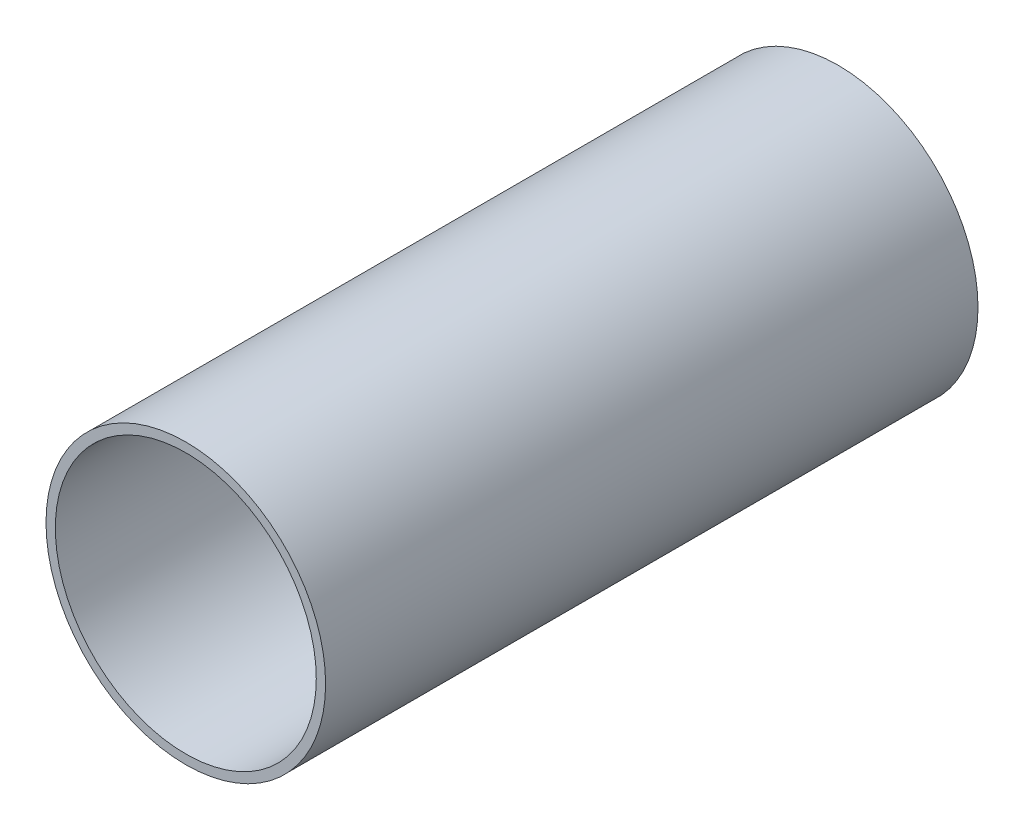
ISO-10303-21;
HEADER;
FILE_DESCRIPTION(('STEP AP214'),'2;1');
FILE_NAME('part.step','',(''),(''),'','','');
FILE_SCHEMA(('AUTOMOTIVE_DESIGN { 1 0 10303 214 1 1 1 1 }'));
ENDSEC;
DATA;
#1=APPLICATION_CONTEXT('core data for automotive mechanical design processes');
#2=APPLICATION_PROTOCOL_DEFINITION('international standard','automotive_design',2000,#1);
#3=PRODUCT_CONTEXT('',#1,'mechanical');
#4=PRODUCT('Part','Part','',(#3));
#5=PRODUCT_RELATED_PRODUCT_CATEGORY('part','',(#4));
#6=PRODUCT_DEFINITION_FORMATION('','',#4);
#7=PRODUCT_DEFINITION_CONTEXT('part definition',#1,'design');
#8=PRODUCT_DEFINITION('design','',#6,#7);
#9=PRODUCT_DEFINITION_SHAPE('','',#8);
#10=(LENGTH_UNIT() NAMED_UNIT(*) SI_UNIT(.MILLI.,.METRE.));
#11=(NAMED_UNIT(*) PLANE_ANGLE_UNIT() SI_UNIT($,.RADIAN.));
#12=(NAMED_UNIT(*) SI_UNIT($,.STERADIAN.) SOLID_ANGLE_UNIT());
#13=UNCERTAINTY_MEASURE_WITH_UNIT(LENGTH_MEASURE(1.E-05),#10,'distance_accuracy_value','');
#14=(GEOMETRIC_REPRESENTATION_CONTEXT(3) GLOBAL_UNCERTAINTY_ASSIGNED_CONTEXT((#13)) GLOBAL_UNIT_ASSIGNED_CONTEXT((#10,
#11,#12)) REPRESENTATION_CONTEXT('',''));
#15=CARTESIAN_POINT('',(0.,0.,0.));
#16=DIRECTION('',(0.,0.,1.));
#17=DIRECTION('',(1.,0.,0.));
#18=AXIS2_PLACEMENT_3D('',#15,#16,#17);
#19=CARTESIAN_POINT('',(0.,0.,70.));
#20=DIRECTION('',(0.,0.,1.));
#21=DIRECTION('',(1.,0.,0.));
#22=AXIS2_PLACEMENT_3D('',#19,#20,#21);
#23=PLANE('',#22);
#24=CARTESIAN_POINT('',(0.,0.,70.));
#25=DIRECTION('',(0.,0.,1.));
#26=DIRECTION('',(1.,0.,0.));
#27=AXIS2_PLACEMENT_3D('',#24,#25,#26);
#28=CIRCLE('',#27,15.);
#29=CARTESIAN_POINT('',(15.,0.,70.));
#30=VERTEX_POINT('',#29);
#31=EDGE_CURVE('E10',#30,#30,#28,.T.);
#32=ORIENTED_EDGE('',*,*,#31,.T.);
#33=EDGE_LOOP('',(#32));
#34=FACE_BOUND('',#33,.T.);
#35=CARTESIAN_POINT('',(0.,0.,70.));
#36=DIRECTION('',(0.,0.,1.));
#37=DIRECTION('',(1.,0.,0.));
#38=AXIS2_PLACEMENT_3D('',#35,#36,#37);
#39=CIRCLE('',#38,14.);
#40=CARTESIAN_POINT('',(14.,0.,70.));
#41=VERTEX_POINT('',#40);
#42=EDGE_CURVE('E42',#41,#41,#39,.T.);
#43=ORIENTED_EDGE('',*,*,#42,.F.);
#44=EDGE_LOOP('',(#43));
#45=FACE_BOUND('',#44,.T.);
#46=ADVANCED_FACE('F31',(#34,#45),#23,.T.);
#47=CARTESIAN_POINT('',(0.,0.,0.));
#48=DIRECTION('',(0.,0.,1.));
#49=DIRECTION('',(1.,0.,0.));
#50=AXIS2_PLACEMENT_3D('',#47,#48,#49);
#51=PLANE('',#50);
#52=CARTESIAN_POINT('',(0.,0.,0.));
#53=DIRECTION('',(0.,0.,1.));
#54=DIRECTION('',(1.,0.,0.));
#55=AXIS2_PLACEMENT_3D('',#52,#53,#54);
#56=CIRCLE('',#55,15.);
#57=CARTESIAN_POINT('',(15.,0.,0.));
#58=VERTEX_POINT('',#57);
#59=EDGE_CURVE('E35',#58,#58,#56,.T.);
#60=ORIENTED_EDGE('',*,*,#59,.F.);
#61=EDGE_LOOP('',(#60));
#62=FACE_BOUND('',#61,.T.);
#63=CARTESIAN_POINT('',(0.,0.,0.));
#64=DIRECTION('',(0.,0.,1.));
#65=DIRECTION('',(1.,0.,0.));
#66=AXIS2_PLACEMENT_3D('',#63,#64,#65);
#67=CIRCLE('',#66,14.);
#68=CARTESIAN_POINT('',(14.,0.,0.));
#69=VERTEX_POINT('',#68);
#70=EDGE_CURVE('E44',#69,#69,#67,.T.);
#71=ORIENTED_EDGE('',*,*,#70,.T.);
#72=EDGE_LOOP('',(#71));
#73=FACE_BOUND('',#72,.T.);
#74=ADVANCED_FACE('F54',(#62,#73),#51,.F.);
#75=CARTESIAN_POINT('',(0.,0.,70.));
#76=DIRECTION('',(0.,0.,-1.));
#77=DIRECTION('',(-1.,0.,0.));
#78=AXIS2_PLACEMENT_3D('',#75,#76,#77);
#79=CYLINDRICAL_SURFACE('',#78,15.);
#80=ORIENTED_EDGE('',*,*,#31,.F.);
#81=EDGE_LOOP('',(#80));
#82=FACE_BOUND('',#81,.T.);
#83=ORIENTED_EDGE('',*,*,#59,.T.);
#84=EDGE_LOOP('',(#83));
#85=FACE_BOUND('',#84,.T.);
#86=ADVANCED_FACE('F33',(#82,#85),#79,.T.);
#87=CARTESIAN_POINT('',(0.,0.,70.));
#88=DIRECTION('',(0.,0.,-1.));
#89=DIRECTION('',(-1.,0.,0.));
#90=AXIS2_PLACEMENT_3D('',#87,#88,#89);
#91=CYLINDRICAL_SURFACE('',#90,14.);
#92=ORIENTED_EDGE('',*,*,#42,.T.);
#93=EDGE_LOOP('',(#92));
#94=FACE_BOUND('',#93,.T.);
#95=ORIENTED_EDGE('',*,*,#70,.F.);
#96=EDGE_LOOP('',(#95));
#97=FACE_BOUND('',#96,.T.);
#98=ADVANCED_FACE('F50',(#94,#97),#91,.F.);
#99=CLOSED_SHELL('',(#46,#74,#86,#98));
#100=MANIFOLD_SOLID_BREP('B2',#99);
#101=ADVANCED_BREP_SHAPE_REPRESENTATION('',(#18,#100),#14);
#102=SHAPE_DEFINITION_REPRESENTATION(#9,#101);
ENDSEC;
END-ISO-10303-21;
